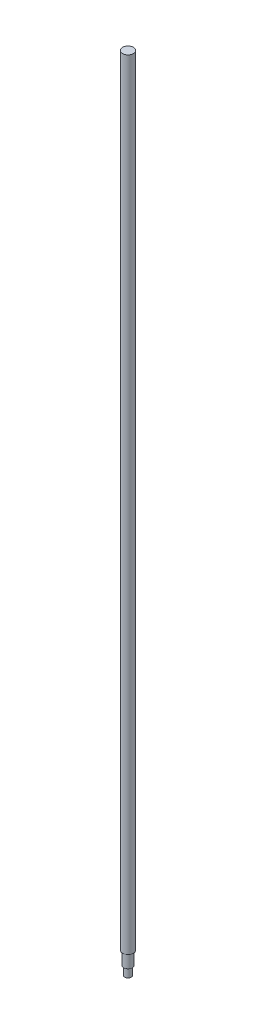
ISO-10303-21;
HEADER;
FILE_DESCRIPTION(('STEP AP214'),'2;1');
FILE_NAME('part.step','',(''),(''),'','','');
FILE_SCHEMA(('AUTOMOTIVE_DESIGN { 1 0 10303 214 1 1 1 1 }'));
ENDSEC;
DATA;
#1=APPLICATION_CONTEXT('core data for automotive mechanical design processes');
#2=APPLICATION_PROTOCOL_DEFINITION('international standard','automotive_design',2000,#1);
#3=PRODUCT_CONTEXT('',#1,'mechanical');
#4=PRODUCT('Part','Part','',(#3));
#5=PRODUCT_RELATED_PRODUCT_CATEGORY('part','',(#4));
#6=PRODUCT_DEFINITION_FORMATION('','',#4);
#7=PRODUCT_DEFINITION_CONTEXT('part definition',#1,'design');
#8=PRODUCT_DEFINITION('design','',#6,#7);
#9=PRODUCT_DEFINITION_SHAPE('','',#8);
#10=(LENGTH_UNIT() NAMED_UNIT(*) SI_UNIT(.MILLI.,.METRE.));
#11=(NAMED_UNIT(*) PLANE_ANGLE_UNIT() SI_UNIT($,.RADIAN.));
#12=(NAMED_UNIT(*) SI_UNIT($,.STERADIAN.) SOLID_ANGLE_UNIT());
#13=UNCERTAINTY_MEASURE_WITH_UNIT(LENGTH_MEASURE(1.E-05),#10,'distance_accuracy_value','');
#14=(GEOMETRIC_REPRESENTATION_CONTEXT(3) GLOBAL_UNCERTAINTY_ASSIGNED_CONTEXT((#13)) GLOBAL_UNIT_ASSIGNED_CONTEXT((#10,
#11,#12)) REPRESENTATION_CONTEXT('',''));
#15=CARTESIAN_POINT('',(0.,0.,0.));
#16=DIRECTION('',(0.,0.,1.));
#17=DIRECTION('',(1.,0.,0.));
#18=AXIS2_PLACEMENT_3D('',#15,#16,#17);
#19=CARTESIAN_POINT('',(0.,1070.,0.));
#20=DIRECTION('',(0.,-1.,0.));
#21=DIRECTION('',(0.,0.,-1.));
#22=AXIS2_PLACEMENT_3D('',#19,#20,#21);
#23=CYLINDRICAL_SURFACE('',#22,7.5);
#24=CARTESIAN_POINT('',(0.,1070.,0.));
#25=DIRECTION('',(0.,1.,0.));
#26=DIRECTION('',(0.,0.,1.));
#27=AXIS2_PLACEMENT_3D('',#24,#25,#26);
#28=CIRCLE('',#27,7.5);
#29=CARTESIAN_POINT('',(0.,1070.,7.5));
#30=VERTEX_POINT('',#29);
#31=EDGE_CURVE('E51',#30,#30,#28,.T.);
#32=ORIENTED_EDGE('',*,*,#31,.F.);
#33=EDGE_LOOP('',(#32));
#34=FACE_BOUND('',#33,.T.);
#35=CARTESIAN_POINT('',(0.,0.,0.));
#36=DIRECTION('',(0.,1.,0.));
#37=DIRECTION('',(0.,0.,1.));
#38=AXIS2_PLACEMENT_3D('',#35,#36,#37);
#39=CIRCLE('',#38,7.5);
#40=CARTESIAN_POINT('',(0.,0.,7.5));
#41=VERTEX_POINT('',#40);
#42=EDGE_CURVE('E40',#41,#41,#39,.T.);
#43=ORIENTED_EDGE('',*,*,#42,.T.);
#44=EDGE_LOOP('',(#43));
#45=FACE_BOUND('',#44,.T.);
#46=ADVANCED_FACE('F37',(#34,#45),#23,.T.);
#47=CARTESIAN_POINT('',(0.,1070.,0.));
#48=DIRECTION('',(0.,1.,0.));
#49=DIRECTION('',(0.,0.,1.));
#50=AXIS2_PLACEMENT_3D('',#47,#48,#49);
#51=PLANE('',#50);
#52=ORIENTED_EDGE('',*,*,#31,.T.);
#53=EDGE_LOOP('',(#52));
#54=FACE_BOUND('',#53,.T.);
#55=ADVANCED_FACE('F71',(#54),#51,.T.);
#56=CARTESIAN_POINT('',(0.,0.,0.));
#57=DIRECTION('',(0.,1.,0.));
#58=DIRECTION('',(0.,0.,1.));
#59=AXIS2_PLACEMENT_3D('',#56,#57,#58);
#60=PLANE('',#59);
#61=CARTESIAN_POINT('',(0.,0.,0.));
#62=DIRECTION('',(0.,-1.,0.));
#63=DIRECTION('',(0.,0.,-1.));
#64=AXIS2_PLACEMENT_3D('',#61,#62,#63);
#65=CIRCLE('',#64,6.);
#66=CARTESIAN_POINT('',(0.,0.,-6.));
#67=VERTEX_POINT('',#66);
#68=EDGE_CURVE('E45',#67,#67,#65,.T.);
#69=ORIENTED_EDGE('',*,*,#68,.F.);
#70=EDGE_LOOP('',(#69));
#71=FACE_BOUND('',#70,.T.);
#72=ORIENTED_EDGE('',*,*,#42,.F.);
#73=EDGE_LOOP('',(#72));
#74=FACE_BOUND('',#73,.T.);
#75=ADVANCED_FACE('F68',(#71,#74),#60,.F.);
#76=CARTESIAN_POINT('',(0.,-18.,0.));
#77=DIRECTION('',(0.,1.,0.));
#78=DIRECTION('',(0.,0.,1.));
#79=AXIS2_PLACEMENT_3D('',#76,#77,#78);
#80=CYLINDRICAL_SURFACE('',#79,6.);
#81=CARTESIAN_POINT('',(0.,-18.,0.));
#82=DIRECTION('',(0.,-1.,0.));
#83=DIRECTION('',(0.,0.,-1.));
#84=AXIS2_PLACEMENT_3D('',#81,#82,#83);
#85=CIRCLE('',#84,6.);
#86=CARTESIAN_POINT('',(0.,-18.,-6.));
#87=VERTEX_POINT('',#86);
#88=EDGE_CURVE('E56',#87,#87,#85,.T.);
#89=ORIENTED_EDGE('',*,*,#88,.F.);
#90=EDGE_LOOP('',(#89));
#91=FACE_BOUND('',#90,.T.);
#92=ORIENTED_EDGE('',*,*,#68,.T.);
#93=EDGE_LOOP('',(#92));
#94=FACE_BOUND('',#93,.T.);
#95=ADVANCED_FACE('F70',(#91,#94),#80,.T.);
#96=CARTESIAN_POINT('',(0.,-18.,0.));
#97=DIRECTION('',(0.,-1.,0.));
#98=DIRECTION('',(0.,0.,-1.));
#99=AXIS2_PLACEMENT_3D('',#96,#97,#98);
#100=PLANE('',#99);
#101=CARTESIAN_POINT('',(0.,-18.,0.));
#102=DIRECTION('',(0.,-1.,0.));
#103=DIRECTION('',(0.,0.,-1.));
#104=AXIS2_PLACEMENT_3D('',#101,#102,#103);
#105=CIRCLE('',#104,4.5);
#106=CARTESIAN_POINT('',(0.,-18.,-4.5));
#107=VERTEX_POINT('',#106);
#108=EDGE_CURVE('E10',#107,#107,#105,.T.);
#109=ORIENTED_EDGE('',*,*,#108,.F.);
#110=EDGE_LOOP('',(#109));
#111=FACE_BOUND('',#110,.T.);
#112=ORIENTED_EDGE('',*,*,#88,.T.);
#113=EDGE_LOOP('',(#112));
#114=FACE_BOUND('',#113,.T.);
#115=ADVANCED_FACE('F77',(#111,#114),#100,.T.);
#116=CARTESIAN_POINT('',(0.,-30.,0.));
#117=DIRECTION('',(0.,1.,0.));
#118=DIRECTION('',(0.,0.,1.));
#119=AXIS2_PLACEMENT_3D('',#116,#117,#118);
#120=CYLINDRICAL_SURFACE('',#119,4.5);
#121=CARTESIAN_POINT('',(0.,-30.,0.));
#122=DIRECTION('',(0.,-1.,0.));
#123=DIRECTION('',(0.,0.,-1.));
#124=AXIS2_PLACEMENT_3D('',#121,#122,#123);
#125=CIRCLE('',#124,4.5);
#126=CARTESIAN_POINT('',(0.,-30.,-4.5));
#127=VERTEX_POINT('',#126);
#128=EDGE_CURVE('E55',#127,#127,#125,.T.);
#129=ORIENTED_EDGE('',*,*,#128,.F.);
#130=EDGE_LOOP('',(#129));
#131=FACE_BOUND('',#130,.T.);
#132=ORIENTED_EDGE('',*,*,#108,.T.);
#133=EDGE_LOOP('',(#132));
#134=FACE_BOUND('',#133,.T.);
#135=ADVANCED_FACE('F109',(#131,#134),#120,.T.);
#136=CARTESIAN_POINT('',(0.,-30.,0.));
#137=DIRECTION('',(0.,-1.,0.));
#138=DIRECTION('',(0.,0.,-1.));
#139=AXIS2_PLACEMENT_3D('',#136,#137,#138);
#140=PLANE('',#139);
#141=ORIENTED_EDGE('',*,*,#128,.T.);
#142=EDGE_LOOP('',(#141));
#143=FACE_BOUND('',#142,.T.);
#144=ADVANCED_FACE('F119',(#143),#140,.T.);
#145=CLOSED_SHELL('',(#46,#55,#75,#95,#115,#135,#144));
#146=MANIFOLD_SOLID_BREP('B2',#145);
#147=ADVANCED_BREP_SHAPE_REPRESENTATION('',(#18,#146),#14);
#148=SHAPE_DEFINITION_REPRESENTATION(#9,#147);
ENDSEC;
END-ISO-10303-21;
